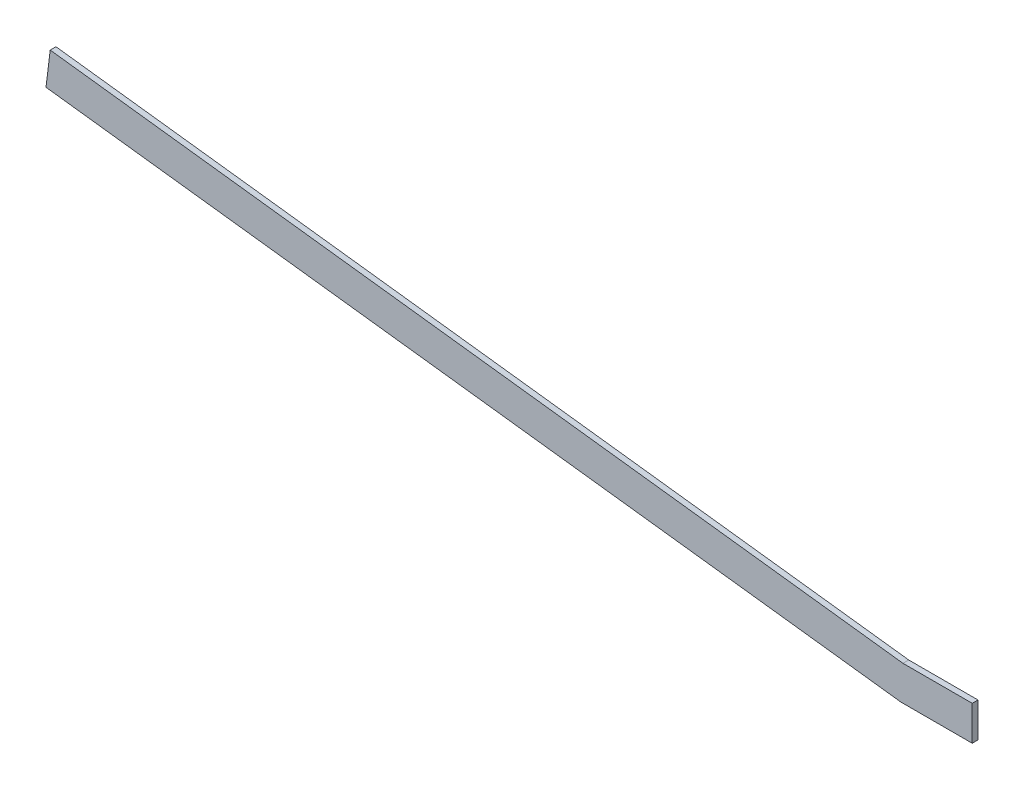
ISO-10303-21;
HEADER;
FILE_DESCRIPTION(('STEP AP214'),'2;1');
FILE_NAME('part.step','',(''),(''),'','','');
FILE_SCHEMA(('AUTOMOTIVE_DESIGN { 1 0 10303 214 1 1 1 1 }'));
ENDSEC;
DATA;
#1=APPLICATION_CONTEXT('core data for automotive mechanical design processes');
#2=APPLICATION_PROTOCOL_DEFINITION('international standard','automotive_design',2000,#1);
#3=PRODUCT_CONTEXT('',#1,'mechanical');
#4=PRODUCT('Part','Part','',(#3));
#5=PRODUCT_RELATED_PRODUCT_CATEGORY('part','',(#4));
#6=PRODUCT_DEFINITION_FORMATION('','',#4);
#7=PRODUCT_DEFINITION_CONTEXT('part definition',#1,'design');
#8=PRODUCT_DEFINITION('design','',#6,#7);
#9=PRODUCT_DEFINITION_SHAPE('','',#8);
#10=(LENGTH_UNIT() NAMED_UNIT(*) SI_UNIT(.MILLI.,.METRE.));
#11=(NAMED_UNIT(*) PLANE_ANGLE_UNIT() SI_UNIT($,.RADIAN.));
#12=(NAMED_UNIT(*) SI_UNIT($,.STERADIAN.) SOLID_ANGLE_UNIT());
#13=UNCERTAINTY_MEASURE_WITH_UNIT(LENGTH_MEASURE(1.E-05),#10,'distance_accuracy_value','');
#14=(GEOMETRIC_REPRESENTATION_CONTEXT(3) GLOBAL_UNCERTAINTY_ASSIGNED_CONTEXT((#13)) GLOBAL_UNIT_ASSIGNED_CONTEXT((#10,
#11,#12)) REPRESENTATION_CONTEXT('',''));
#15=CARTESIAN_POINT('',(0.,0.,0.));
#16=DIRECTION('',(0.,0.,1.));
#17=DIRECTION('',(1.,0.,0.));
#18=AXIS2_PLACEMENT_3D('',#15,#16,#17);
#19=CARTESIAN_POINT('',(0.,0.,3.175));
#20=DIRECTION('',(0.,-1.,0.));
#21=DIRECTION('',(1.,0.,0.));
#22=AXIS2_PLACEMENT_3D('',#19,#20,#21);
#23=PLANE('',#22);
#24=DIRECTION('',(-1.,0.,0.));
#25=VECTOR('',#24,1.);
#26=CARTESIAN_POINT('',(0.,0.,-3.175));
#27=LINE('',#26,#25);
#28=CARTESIAN_POINT('',(78.5302958277344,0.,-3.175));
#29=VERTEX_POINT('',#28);
#30=CARTESIAN_POINT('',(0.,0.,-3.175));
#31=VERTEX_POINT('',#30);
#32=EDGE_CURVE('E127',#29,#31,#27,.T.);
#33=ORIENTED_EDGE('',*,*,#32,.F.);
#34=DIRECTION('',(0.,0.,-1.));
#35=VECTOR('',#34,1.);
#36=CARTESIAN_POINT('',(78.5302958277344,0.,3.175));
#37=LINE('',#36,#35);
#38=CARTESIAN_POINT('',(78.5302958277344,0.,3.175));
#39=VERTEX_POINT('',#38);
#40=EDGE_CURVE('E11',#39,#29,#37,.T.);
#41=ORIENTED_EDGE('',*,*,#40,.F.);
#42=DIRECTION('',(-1.,0.,0.));
#43=VECTOR('',#42,1.);
#44=CARTESIAN_POINT('',(0.,0.,3.175));
#45=LINE('',#44,#43);
#46=CARTESIAN_POINT('',(0.,0.,3.175));
#47=VERTEX_POINT('',#46);
#48=EDGE_CURVE('E147',#39,#47,#45,.T.);
#49=ORIENTED_EDGE('',*,*,#48,.T.);
#50=DIRECTION('',(0.,0.,-1.));
#51=VECTOR('',#50,1.);
#52=CARTESIAN_POINT('',(0.,0.,3.175));
#53=LINE('',#52,#51);
#54=EDGE_CURVE('E58',#47,#31,#53,.T.);
#55=ORIENTED_EDGE('',*,*,#54,.T.);
#56=EDGE_LOOP('',(#33,#41,#49,#55));
#57=FACE_BOUND('',#56,.T.);
#58=ADVANCED_FACE('F41',(#57),#23,.T.);
#59=CARTESIAN_POINT('',(78.5302958277344,0.,3.175));
#60=DIRECTION('',(1.,0.,0.));
#61=DIRECTION('',(0.,0.,-1.));
#62=AXIS2_PLACEMENT_3D('',#59,#60,#61);
#63=PLANE('',#62);
#64=DIRECTION('',(0.,-1.,0.));
#65=VECTOR('',#64,1.);
#66=CARTESIAN_POINT('',(78.5302958277344,0.,-3.175));
#67=LINE('',#66,#65);
#68=CARTESIAN_POINT('',(78.5302958277344,38.1,-3.175));
#69=VERTEX_POINT('',#68);
#70=EDGE_CURVE('E130',#69,#29,#67,.T.);
#71=ORIENTED_EDGE('',*,*,#70,.F.);
#72=DIRECTION('',(0.,0.,-1.));
#73=VECTOR('',#72,1.);
#74=CARTESIAN_POINT('',(78.5302958277344,38.1,3.175));
#75=LINE('',#74,#73);
#76=CARTESIAN_POINT('',(78.5302958277344,38.1,3.175));
#77=VERTEX_POINT('',#76);
#78=EDGE_CURVE('E50',#77,#69,#75,.T.);
#79=ORIENTED_EDGE('',*,*,#78,.F.);
#80=DIRECTION('',(0.,-1.,0.));
#81=VECTOR('',#80,1.);
#82=CARTESIAN_POINT('',(78.5302958277344,0.,3.175));
#83=LINE('',#82,#81);
#84=EDGE_CURVE('E226',#77,#39,#83,.T.);
#85=ORIENTED_EDGE('',*,*,#84,.T.);
#86=ORIENTED_EDGE('',*,*,#40,.T.);
#87=EDGE_LOOP('',(#71,#79,#85,#86));
#88=FACE_BOUND('',#87,.T.);
#89=ADVANCED_FACE('F160',(#88),#63,.T.);
#90=CARTESIAN_POINT('',(0.,38.1,3.175));
#91=DIRECTION('',(0.,1.,0.));
#92=DIRECTION('',(-1.,0.,0.));
#93=AXIS2_PLACEMENT_3D('',#90,#91,#92);
#94=PLANE('',#93);
#95=DIRECTION('',(1.,0.,0.));
#96=VECTOR('',#95,1.);
#97=CARTESIAN_POINT('',(0.,38.1,-3.175));
#98=LINE('',#97,#96);
#99=CARTESIAN_POINT('',(2.33029582773423,38.1,-3.175));
#100=VERTEX_POINT('',#99);
#101=EDGE_CURVE('E134',#100,#69,#98,.T.);
#102=ORIENTED_EDGE('',*,*,#101,.F.);
#103=DIRECTION('',(0.,0.,-1.));
#104=VECTOR('',#103,1.);
#105=CARTESIAN_POINT('',(2.33029582773423,38.1,3.175));
#106=LINE('',#105,#104);
#107=CARTESIAN_POINT('',(2.33029582773423,38.1,3.175));
#108=VERTEX_POINT('',#107);
#109=EDGE_CURVE('E106',#108,#100,#106,.T.);
#110=ORIENTED_EDGE('',*,*,#109,.F.);
#111=DIRECTION('',(1.,0.,0.));
#112=VECTOR('',#111,1.);
#113=CARTESIAN_POINT('',(0.,38.1,3.175));
#114=LINE('',#113,#112);
#115=EDGE_CURVE('E116',#108,#77,#114,.T.);
#116=ORIENTED_EDGE('',*,*,#115,.T.);
#117=ORIENTED_EDGE('',*,*,#78,.T.);
#118=EDGE_LOOP('',(#102,#110,#116,#117));
#119=FACE_BOUND('',#118,.T.);
#120=ADVANCED_FACE('F157',(#119),#94,.T.);
#121=CARTESIAN_POINT('',(4.64322198373613,37.8160083775344,3.175));
#122=DIRECTION('',(0.121869343405148,0.992546151641322,0.));
#123=DIRECTION('',(-0.992546151641322,0.121869343405148,0.));
#124=AXIS2_PLACEMENT_3D('',#121,#122,#123);
#125=PLANE('',#124);
#126=DIRECTION('',(0.992546151641322,-0.121869343405148,0.));
#127=VECTOR('',#126,1.);
#128=CARTESIAN_POINT('',(4.64322198373613,37.8160083775344,-3.175));
#129=LINE('',#128,#127);
#130=CARTESIAN_POINT('',(-936.36585205901,153.357394339522,-3.175));
#131=VERTEX_POINT('',#130);
#132=EDGE_CURVE('E101',#131,#100,#129,.T.);
#133=ORIENTED_EDGE('',*,*,#132,.F.);
#134=DIRECTION('',(0.,0.,-1.));
#135=VECTOR('',#134,1.);
#136=CARTESIAN_POINT('',(-936.36585205901,153.357394339522,3.175));
#137=LINE('',#136,#135);
#138=CARTESIAN_POINT('',(-936.36585205901,153.357394339522,3.175));
#139=VERTEX_POINT('',#138);
#140=EDGE_CURVE('E96',#139,#131,#137,.T.);
#141=ORIENTED_EDGE('',*,*,#140,.F.);
#142=DIRECTION('',(0.992546151641322,-0.121869343405148,0.));
#143=VECTOR('',#142,1.);
#144=CARTESIAN_POINT('',(4.64322198373613,37.8160083775344,3.175));
#145=LINE('',#144,#143);
#146=EDGE_CURVE('E99',#139,#108,#145,.T.);
#147=ORIENTED_EDGE('',*,*,#146,.T.);
#148=ORIENTED_EDGE('',*,*,#109,.T.);
#149=EDGE_LOOP('',(#133,#141,#147,#148));
#150=FACE_BOUND('',#149,.T.);
#151=ADVANCED_FACE('F98',(#150),#125,.T.);
#152=CARTESIAN_POINT('',(-941.009074042746,115.541385961993,3.175));
#153=DIRECTION('',(-0.992546151641321,0.121869343405153,0.));
#154=DIRECTION('',(-0.121869343405153,-0.992546151641321,0.));
#155=AXIS2_PLACEMENT_3D('',#152,#153,#154);
#156=PLANE('',#155);
#157=DIRECTION('',(0.121869343405153,0.992546151641321,0.));
#158=VECTOR('',#157,1.);
#159=CARTESIAN_POINT('',(-941.009074042746,115.541385961993,-3.175));
#160=LINE('',#159,#158);
#161=CARTESIAN_POINT('',(-941.009074042746,115.541385961988,-3.175));
#162=VERTEX_POINT('',#161);
#163=EDGE_CURVE('E140',#162,#131,#160,.T.);
#164=ORIENTED_EDGE('',*,*,#163,.F.);
#165=DIRECTION('',(0.,0.,-1.));
#166=VECTOR('',#165,1.);
#167=CARTESIAN_POINT('',(-941.009074042746,115.541385961988,3.175));
#168=LINE('',#167,#166);
#169=CARTESIAN_POINT('',(-941.009074042746,115.541385961988,3.175));
#170=VERTEX_POINT('',#169);
#171=EDGE_CURVE('E77',#170,#162,#168,.T.);
#172=ORIENTED_EDGE('',*,*,#171,.F.);
#173=DIRECTION('',(0.121869343405153,0.992546151641321,0.));
#174=VECTOR('',#173,1.);
#175=CARTESIAN_POINT('',(-941.009074042746,115.541385961993,3.175));
#176=LINE('',#175,#174);
#177=EDGE_CURVE('E113',#170,#139,#176,.T.);
#178=ORIENTED_EDGE('',*,*,#177,.T.);
#179=ORIENTED_EDGE('',*,*,#140,.T.);
#180=EDGE_LOOP('',(#164,#172,#178,#179));
#181=FACE_BOUND('',#180,.T.);
#182=ADVANCED_FACE('F119',(#181),#156,.T.);
#183=CARTESIAN_POINT('',(0.,0.,3.175));
#184=DIRECTION('',(-0.121869343405148,-0.992546151641322,0.));
#185=DIRECTION('',(0.992546151641322,-0.121869343405148,0.));
#186=AXIS2_PLACEMENT_3D('',#183,#184,#185);
#187=PLANE('',#186);
#188=DIRECTION('',(-0.992546151641322,0.121869343405148,0.));
#189=VECTOR('',#188,1.);
#190=CARTESIAN_POINT('',(0.,0.,-3.175));
#191=LINE('',#190,#189);
#192=EDGE_CURVE('E143',#31,#162,#191,.T.);
#193=ORIENTED_EDGE('',*,*,#192,.F.);
#194=ORIENTED_EDGE('',*,*,#54,.F.);
#195=DIRECTION('',(-0.992546151641322,0.121869343405148,0.));
#196=VECTOR('',#195,1.);
#197=CARTESIAN_POINT('',(0.,0.,3.175));
#198=LINE('',#197,#196);
#199=EDGE_CURVE('E121',#47,#170,#198,.T.);
#200=ORIENTED_EDGE('',*,*,#199,.T.);
#201=ORIENTED_EDGE('',*,*,#171,.T.);
#202=EDGE_LOOP('',(#193,#194,#200,#201));
#203=FACE_BOUND('',#202,.T.);
#204=ADVANCED_FACE('F163',(#203),#187,.T.);
#205=CARTESIAN_POINT('',(0.,0.,3.175));
#206=DIRECTION('',(0.,0.,1.));
#207=DIRECTION('',(1.,0.,0.));
#208=AXIS2_PLACEMENT_3D('',#205,#206,#207);
#209=PLANE('',#208);
#210=ORIENTED_EDGE('',*,*,#48,.F.);
#211=ORIENTED_EDGE('',*,*,#84,.F.);
#212=ORIENTED_EDGE('',*,*,#115,.F.);
#213=ORIENTED_EDGE('',*,*,#146,.F.);
#214=ORIENTED_EDGE('',*,*,#177,.F.);
#215=ORIENTED_EDGE('',*,*,#199,.F.);
#216=EDGE_LOOP('',(#210,#211,#212,#213,#214,#215));
#217=FACE_BOUND('',#216,.T.);
#218=ADVANCED_FACE('F111',(#217),#209,.T.);
#219=CARTESIAN_POINT('',(0.,0.,-3.175));
#220=DIRECTION('',(0.,0.,1.));
#221=DIRECTION('',(1.,0.,0.));
#222=AXIS2_PLACEMENT_3D('',#219,#220,#221);
#223=PLANE('',#222);
#224=ORIENTED_EDGE('',*,*,#32,.T.);
#225=ORIENTED_EDGE('',*,*,#192,.T.);
#226=ORIENTED_EDGE('',*,*,#163,.T.);
#227=ORIENTED_EDGE('',*,*,#132,.T.);
#228=ORIENTED_EDGE('',*,*,#101,.T.);
#229=ORIENTED_EDGE('',*,*,#70,.T.);
#230=EDGE_LOOP('',(#224,#225,#226,#227,#228,#229));
#231=FACE_BOUND('',#230,.T.);
#232=ADVANCED_FACE('F162',(#231),#223,.F.);
#233=CLOSED_SHELL('',(#58,#89,#120,#151,#182,#204,#218,#232));
#234=MANIFOLD_SOLID_BREP('B2',#233);
#235=ADVANCED_BREP_SHAPE_REPRESENTATION('',(#18,#234),#14);
#236=SHAPE_DEFINITION_REPRESENTATION(#9,#235);
ENDSEC;
END-ISO-10303-21;
